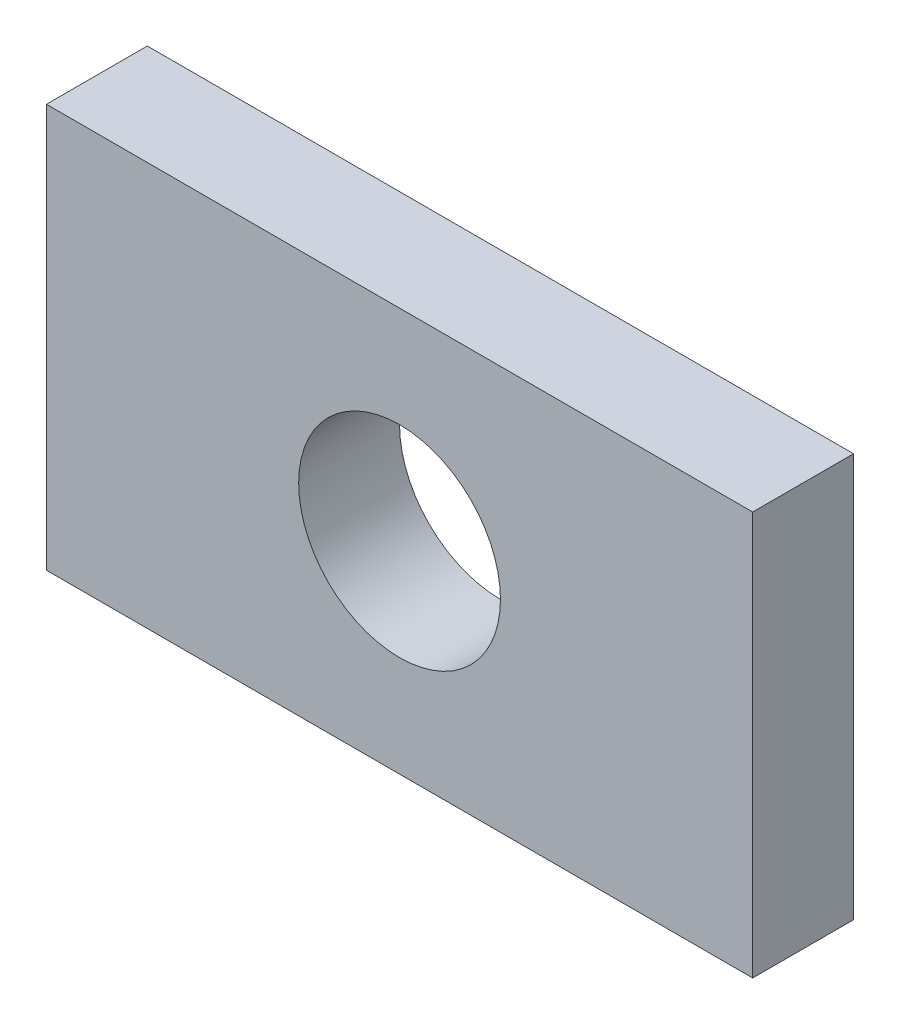
ISO-10303-21;
HEADER;
FILE_DESCRIPTION(('STEP AP214'),'2;1');
FILE_NAME('part.step','',(''),(''),'','','');
FILE_SCHEMA(('AUTOMOTIVE_DESIGN { 1 0 10303 214 1 1 1 1 }'));
ENDSEC;
DATA;
#1=APPLICATION_CONTEXT('core data for automotive mechanical design processes');
#2=APPLICATION_PROTOCOL_DEFINITION('international standard','automotive_design',2000,#1);
#3=PRODUCT_CONTEXT('',#1,'mechanical');
#4=PRODUCT('Part','Part','',(#3));
#5=PRODUCT_RELATED_PRODUCT_CATEGORY('part','',(#4));
#6=PRODUCT_DEFINITION_FORMATION('','',#4);
#7=PRODUCT_DEFINITION_CONTEXT('part definition',#1,'design');
#8=PRODUCT_DEFINITION('design','',#6,#7);
#9=PRODUCT_DEFINITION_SHAPE('','',#8);
#10=(LENGTH_UNIT() NAMED_UNIT(*) SI_UNIT(.MILLI.,.METRE.));
#11=(NAMED_UNIT(*) PLANE_ANGLE_UNIT() SI_UNIT($,.RADIAN.));
#12=(NAMED_UNIT(*) SI_UNIT($,.STERADIAN.) SOLID_ANGLE_UNIT());
#13=UNCERTAINTY_MEASURE_WITH_UNIT(LENGTH_MEASURE(1.E-05),#10,'distance_accuracy_value','');
#14=(GEOMETRIC_REPRESENTATION_CONTEXT(3) GLOBAL_UNCERTAINTY_ASSIGNED_CONTEXT((#13)) GLOBAL_UNIT_ASSIGNED_CONTEXT((#10,
#11,#12)) REPRESENTATION_CONTEXT('',''));
#15=CARTESIAN_POINT('',(0.,0.,0.));
#16=DIRECTION('',(0.,0.,1.));
#17=DIRECTION('',(1.,0.,0.));
#18=AXIS2_PLACEMENT_3D('',#15,#16,#17);
#19=CARTESIAN_POINT('',(0.,0.,2.54));
#20=DIRECTION('',(0.,0.,-1.));
#21=DIRECTION('',(-1.,0.,0.));
#22=AXIS2_PLACEMENT_3D('',#19,#20,#21);
#23=PLANE('',#22);
#24=DIRECTION('',(0.,-1.,0.));
#25=VECTOR('',#24,1.);
#26=CARTESIAN_POINT('',(0.,0.,2.54));
#27=LINE('',#26,#25);
#28=CARTESIAN_POINT('',(0.,10.16,2.54));
#29=VERTEX_POINT('',#28);
#30=CARTESIAN_POINT('',(0.,0.,2.54));
#31=VERTEX_POINT('',#30);
#32=EDGE_CURVE('E86',#29,#31,#27,.T.);
#33=ORIENTED_EDGE('',*,*,#32,.T.);
#34=DIRECTION('',(1.,0.,0.));
#35=VECTOR('',#34,1.);
#36=CARTESIAN_POINT('',(0.,0.,2.54));
#37=LINE('',#36,#35);
#38=CARTESIAN_POINT('',(17.78,0.,2.54));
#39=VERTEX_POINT('',#38);
#40=EDGE_CURVE('E81',#31,#39,#37,.T.);
#41=ORIENTED_EDGE('',*,*,#40,.T.);
#42=DIRECTION('',(0.,1.,0.));
#43=VECTOR('',#42,1.);
#44=CARTESIAN_POINT('',(17.78,0.,2.54));
#45=LINE('',#44,#43);
#46=CARTESIAN_POINT('',(17.78,10.16,2.54));
#47=VERTEX_POINT('',#46);
#48=EDGE_CURVE('E84',#39,#47,#45,.T.);
#49=ORIENTED_EDGE('',*,*,#48,.T.);
#50=DIRECTION('',(-1.,0.,0.));
#51=VECTOR('',#50,1.);
#52=CARTESIAN_POINT('',(0.,10.16,2.54));
#53=LINE('',#52,#51);
#54=EDGE_CURVE('E51',#47,#29,#53,.T.);
#55=ORIENTED_EDGE('',*,*,#54,.T.);
#56=EDGE_LOOP('',(#33,#41,#49,#55));
#57=FACE_BOUND('',#56,.T.);
#58=CARTESIAN_POINT('',(8.89,5.08,2.54));
#59=DIRECTION('',(0.,0.,1.));
#60=DIRECTION('',(1.,0.,0.));
#61=AXIS2_PLACEMENT_3D('',#58,#59,#60);
#62=CIRCLE('',#61,2.54);
#63=CARTESIAN_POINT('',(11.43,5.08,2.54));
#64=VERTEX_POINT('',#63);
#65=EDGE_CURVE('E101',#64,#64,#62,.T.);
#66=ORIENTED_EDGE('',*,*,#65,.F.);
#67=EDGE_LOOP('',(#66));
#68=FACE_BOUND('',#67,.T.);
#69=ADVANCED_FACE('F34',(#57,#68),#23,.F.);
#70=CARTESIAN_POINT('',(0.,0.,0.));
#71=DIRECTION('',(0.,0.,-1.));
#72=DIRECTION('',(-1.,0.,0.));
#73=AXIS2_PLACEMENT_3D('',#70,#71,#72);
#74=PLANE('',#73);
#75=DIRECTION('',(0.,-1.,0.));
#76=VECTOR('',#75,1.);
#77=CARTESIAN_POINT('',(0.,0.,0.));
#78=LINE('',#77,#76);
#79=CARTESIAN_POINT('',(0.,10.16,0.));
#80=VERTEX_POINT('',#79);
#81=CARTESIAN_POINT('',(0.,0.,0.));
#82=VERTEX_POINT('',#81);
#83=EDGE_CURVE('E98',#80,#82,#78,.T.);
#84=ORIENTED_EDGE('',*,*,#83,.F.);
#85=DIRECTION('',(-1.,0.,0.));
#86=VECTOR('',#85,1.);
#87=CARTESIAN_POINT('',(0.,10.16,0.));
#88=LINE('',#87,#86);
#89=CARTESIAN_POINT('',(17.78,10.16,0.));
#90=VERTEX_POINT('',#89);
#91=EDGE_CURVE('E74',#90,#80,#88,.T.);
#92=ORIENTED_EDGE('',*,*,#91,.F.);
#93=DIRECTION('',(0.,1.,0.));
#94=VECTOR('',#93,1.);
#95=CARTESIAN_POINT('',(17.78,0.,0.));
#96=LINE('',#95,#94);
#97=CARTESIAN_POINT('',(17.78,0.,0.));
#98=VERTEX_POINT('',#97);
#99=EDGE_CURVE('E68',#98,#90,#96,.T.);
#100=ORIENTED_EDGE('',*,*,#99,.F.);
#101=DIRECTION('',(1.,0.,0.));
#102=VECTOR('',#101,1.);
#103=CARTESIAN_POINT('',(0.,0.,0.));
#104=LINE('',#103,#102);
#105=EDGE_CURVE('E90',#82,#98,#104,.T.);
#106=ORIENTED_EDGE('',*,*,#105,.F.);
#107=EDGE_LOOP('',(#84,#92,#100,#106));
#108=FACE_BOUND('',#107,.T.);
#109=CARTESIAN_POINT('',(8.89,5.08,0.));
#110=DIRECTION('',(0.,0.,1.));
#111=DIRECTION('',(1.,0.,0.));
#112=AXIS2_PLACEMENT_3D('',#109,#110,#111);
#113=CIRCLE('',#112,2.54);
#114=CARTESIAN_POINT('',(11.43,5.08,0.));
#115=VERTEX_POINT('',#114);
#116=EDGE_CURVE('E113',#115,#115,#113,.T.);
#117=ORIENTED_EDGE('',*,*,#116,.T.);
#118=EDGE_LOOP('',(#117));
#119=FACE_BOUND('',#118,.T.);
#120=ADVANCED_FACE('F109',(#108,#119),#74,.T.);
#121=CARTESIAN_POINT('',(0.,0.,2.54));
#122=DIRECTION('',(1.,0.,0.));
#123=DIRECTION('',(0.,0.,-1.));
#124=AXIS2_PLACEMENT_3D('',#121,#122,#123);
#125=PLANE('',#124);
#126=ORIENTED_EDGE('',*,*,#83,.T.);
#127=DIRECTION('',(0.,0.,-1.));
#128=VECTOR('',#127,1.);
#129=CARTESIAN_POINT('',(0.,0.,2.54));
#130=LINE('',#129,#128);
#131=EDGE_CURVE('E11',#31,#82,#130,.T.);
#132=ORIENTED_EDGE('',*,*,#131,.F.);
#133=ORIENTED_EDGE('',*,*,#32,.F.);
#134=DIRECTION('',(0.,0.,-1.));
#135=VECTOR('',#134,1.);
#136=CARTESIAN_POINT('',(0.,10.16,2.54));
#137=LINE('',#136,#135);
#138=EDGE_CURVE('E94',#29,#80,#137,.T.);
#139=ORIENTED_EDGE('',*,*,#138,.T.);
#140=EDGE_LOOP('',(#126,#132,#133,#139));
#141=FACE_BOUND('',#140,.T.);
#142=ADVANCED_FACE('F36',(#141),#125,.F.);
#143=CARTESIAN_POINT('',(0.,0.,2.54));
#144=DIRECTION('',(0.,1.,0.));
#145=DIRECTION('',(0.,0.,1.));
#146=AXIS2_PLACEMENT_3D('',#143,#144,#145);
#147=PLANE('',#146);
#148=ORIENTED_EDGE('',*,*,#105,.T.);
#149=DIRECTION('',(0.,0.,-1.));
#150=VECTOR('',#149,1.);
#151=CARTESIAN_POINT('',(17.78,0.,2.54));
#152=LINE('',#151,#150);
#153=EDGE_CURVE('E43',#39,#98,#152,.T.);
#154=ORIENTED_EDGE('',*,*,#153,.F.);
#155=ORIENTED_EDGE('',*,*,#40,.F.);
#156=ORIENTED_EDGE('',*,*,#131,.T.);
#157=EDGE_LOOP('',(#148,#154,#155,#156));
#158=FACE_BOUND('',#157,.T.);
#159=ADVANCED_FACE('F89',(#158),#147,.F.);
#160=CARTESIAN_POINT('',(17.78,0.,2.54));
#161=DIRECTION('',(-1.,0.,0.));
#162=DIRECTION('',(0.,0.,1.));
#163=AXIS2_PLACEMENT_3D('',#160,#161,#162);
#164=PLANE('',#163);
#165=ORIENTED_EDGE('',*,*,#99,.T.);
#166=DIRECTION('',(0.,0.,-1.));
#167=VECTOR('',#166,1.);
#168=CARTESIAN_POINT('',(17.78,10.16,2.54));
#169=LINE('',#168,#167);
#170=EDGE_CURVE('E91',#47,#90,#169,.T.);
#171=ORIENTED_EDGE('',*,*,#170,.F.);
#172=ORIENTED_EDGE('',*,*,#48,.F.);
#173=ORIENTED_EDGE('',*,*,#153,.T.);
#174=EDGE_LOOP('',(#165,#171,#172,#173));
#175=FACE_BOUND('',#174,.T.);
#176=ADVANCED_FACE('F92',(#175),#164,.F.);
#177=CARTESIAN_POINT('',(0.,10.16,2.54));
#178=DIRECTION('',(0.,-1.,0.));
#179=DIRECTION('',(0.,0.,-1.));
#180=AXIS2_PLACEMENT_3D('',#177,#178,#179);
#181=PLANE('',#180);
#182=ORIENTED_EDGE('',*,*,#91,.T.);
#183=ORIENTED_EDGE('',*,*,#138,.F.);
#184=ORIENTED_EDGE('',*,*,#54,.F.);
#185=ORIENTED_EDGE('',*,*,#170,.T.);
#186=EDGE_LOOP('',(#182,#183,#184,#185));
#187=FACE_BOUND('',#186,.T.);
#188=ADVANCED_FACE('F106',(#187),#181,.F.);
#189=CARTESIAN_POINT('',(8.89,5.08,2.54));
#190=DIRECTION('',(0.,0.,-1.));
#191=DIRECTION('',(-1.,0.,0.));
#192=AXIS2_PLACEMENT_3D('',#189,#190,#191);
#193=CYLINDRICAL_SURFACE('',#192,2.54);
#194=ORIENTED_EDGE('',*,*,#65,.T.);
#195=EDGE_LOOP('',(#194));
#196=FACE_BOUND('',#195,.T.);
#197=ORIENTED_EDGE('',*,*,#116,.F.);
#198=EDGE_LOOP('',(#197));
#199=FACE_BOUND('',#198,.T.);
#200=ADVANCED_FACE('F119',(#196,#199),#193,.F.);
#201=CLOSED_SHELL('',(#69,#120,#142,#159,#176,#188,#200));
#202=MANIFOLD_SOLID_BREP('B2',#201);
#203=ADVANCED_BREP_SHAPE_REPRESENTATION('',(#18,#202),#14);
#204=SHAPE_DEFINITION_REPRESENTATION(#9,#203);
ENDSEC;
END-ISO-10303-21;
